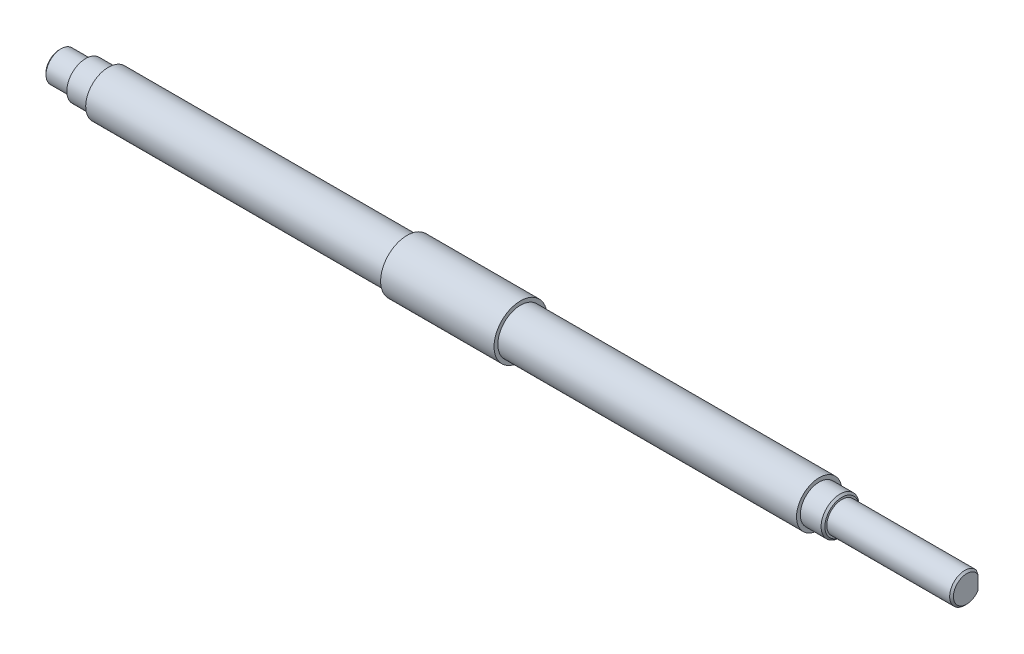
ISO-10303-21;
HEADER;
FILE_DESCRIPTION(('STEP AP214'),'2;1');
FILE_NAME('part.step','',(''),(''),'','','');
FILE_SCHEMA(('AUTOMOTIVE_DESIGN { 1 0 10303 214 1 1 1 1 }'));
ENDSEC;
DATA;
#1=APPLICATION_CONTEXT('core data for automotive mechanical design processes');
#2=APPLICATION_PROTOCOL_DEFINITION('international standard','automotive_design',2000,#1);
#3=PRODUCT_CONTEXT('',#1,'mechanical');
#4=PRODUCT('Part','Part','',(#3));
#5=PRODUCT_RELATED_PRODUCT_CATEGORY('part','',(#4));
#6=PRODUCT_DEFINITION_FORMATION('','',#4);
#7=PRODUCT_DEFINITION_CONTEXT('part definition',#1,'design');
#8=PRODUCT_DEFINITION('design','',#6,#7);
#9=PRODUCT_DEFINITION_SHAPE('','',#8);
#10=(LENGTH_UNIT() NAMED_UNIT(*) SI_UNIT(.MILLI.,.METRE.));
#11=(NAMED_UNIT(*) PLANE_ANGLE_UNIT() SI_UNIT($,.RADIAN.));
#12=(NAMED_UNIT(*) SI_UNIT($,.STERADIAN.) SOLID_ANGLE_UNIT());
#13=UNCERTAINTY_MEASURE_WITH_UNIT(LENGTH_MEASURE(1.E-05),#10,'distance_accuracy_value','');
#14=(GEOMETRIC_REPRESENTATION_CONTEXT(3) GLOBAL_UNCERTAINTY_ASSIGNED_CONTEXT((#13)) GLOBAL_UNIT_ASSIGNED_CONTEXT((#10,
#11,#12)) REPRESENTATION_CONTEXT('',''));
#15=CARTESIAN_POINT('',(0.,0.,0.));
#16=DIRECTION('',(0.,0.,1.));
#17=DIRECTION('',(1.,0.,0.));
#18=AXIS2_PLACEMENT_3D('',#15,#16,#17);
#19=CARTESIAN_POINT('',(-107.,0.,0.));
#20=DIRECTION('',(-1.,0.,0.));
#21=DIRECTION('',(0.,-1.,0.));
#22=AXIS2_PLACEMENT_3D('',#19,#20,#21);
#23=CYLINDRICAL_SURFACE('',#22,4.);
#24=CARTESIAN_POINT('',(100.,0.,0.));
#25=DIRECTION('',(-1.,0.,0.));
#26=DIRECTION('',(0.,-1.,0.));
#27=AXIS2_PLACEMENT_3D('',#24,#25,#26);
#28=CIRCLE('',#27,4.);
#29=CARTESIAN_POINT('',(100.,-3.99999999999993,0.));
#30=VERTEX_POINT('',#29);
#31=EDGE_CURVE('E87',#30,#30,#28,.T.);
#32=ORIENTED_EDGE('',*,*,#31,.F.);
#33=EDGE_LOOP('',(#32));
#34=FACE_BOUND('',#33,.T.);
#35=DIRECTION('',(-1.,0.,0.));
#36=VECTOR('',#35,1.);
#37=CARTESIAN_POINT('',(-107.,-2.64575131106457,-3.));
#38=LINE('',#37,#36);
#39=CARTESIAN_POINT('',(132.5,-2.64575131106451,-3.));
#40=VERTEX_POINT('',#39);
#41=CARTESIAN_POINT('',(113.,-2.64575131106452,-3.));
#42=VERTEX_POINT('',#41);
#43=EDGE_CURVE('E82',#40,#42,#38,.T.);
#44=ORIENTED_EDGE('',*,*,#43,.F.);
#45=CARTESIAN_POINT('',(132.5,0.,0.));
#46=DIRECTION('',(-1.,0.,0.));
#47=DIRECTION('',(0.,-1.,0.));
#48=AXIS2_PLACEMENT_3D('',#45,#46,#47);
#49=CIRCLE('',#48,4.);
#50=CARTESIAN_POINT('',(132.5,2.64575131106467,-3.));
#51=VERTEX_POINT('',#50);
#52=EDGE_CURVE('E77',#40,#51,#49,.T.);
#53=ORIENTED_EDGE('',*,*,#52,.T.);
#54=DIRECTION('',(-1.,0.,0.));
#55=VECTOR('',#54,1.);
#56=CARTESIAN_POINT('',(-107.,2.64575131106461,-3.));
#57=LINE('',#56,#55);
#58=CARTESIAN_POINT('',(113.,2.64575131106466,-3.));
#59=VERTEX_POINT('',#58);
#60=EDGE_CURVE('E81',#59,#51,#57,.F.);
#61=ORIENTED_EDGE('',*,*,#60,.F.);
#62=CARTESIAN_POINT('',(113.,0.,0.));
#63=DIRECTION('',(-1.,0.,0.));
#64=DIRECTION('',(0.,0.,1.));
#65=AXIS2_PLACEMENT_3D('',#62,#63,#64);
#66=CIRCLE('',#65,4.);
#67=EDGE_CURVE('E70',#59,#42,#66,.T.);
#68=ORIENTED_EDGE('',*,*,#67,.T.);
#69=EDGE_LOOP('',(#44,#53,#61,#68));
#70=FACE_BOUND('',#69,.T.);
#71=ADVANCED_FACE('F35',(#34,#70),#23,.T.);
#72=CARTESIAN_POINT('',(133.,4.00000000000008,0.));
#73=DIRECTION('',(-1.,0.,0.));
#74=DIRECTION('',(0.,-1.,0.));
#75=AXIS2_PLACEMENT_3D('',#72,#73,#74);
#76=PLANE('',#75);
#77=DIRECTION('',(0.,-1.,0.));
#78=VECTOR('',#77,1.);
#79=CARTESIAN_POINT('',(133.,4.00000000000008,-3.));
#80=LINE('',#79,#78);
#81=CARTESIAN_POINT('',(133.,1.80277563773218,-3.));
#82=VERTEX_POINT('',#81);
#83=CARTESIAN_POINT('',(133.,-1.80277563773203,-3.));
#84=VERTEX_POINT('',#83);
#85=EDGE_CURVE('E78',#82,#84,#80,.T.);
#86=ORIENTED_EDGE('',*,*,#85,.F.);
#87=CARTESIAN_POINT('',(133.,0.,0.));
#88=DIRECTION('',(-1.,0.,0.));
#89=DIRECTION('',(0.,-1.,0.));
#90=AXIS2_PLACEMENT_3D('',#87,#88,#89);
#91=CIRCLE('',#90,3.50000000000006);
#92=EDGE_CURVE('E49',#82,#84,#91,.F.);
#93=ORIENTED_EDGE('',*,*,#92,.T.);
#94=EDGE_LOOP('',(#86,#93));
#95=FACE_BOUND('',#94,.T.);
#96=ADVANCED_FACE('F155',(#95),#76,.F.);
#97=CARTESIAN_POINT('',(-107.,0.,0.));
#98=DIRECTION('',(1.,0.,0.));
#99=DIRECTION('',(0.,1.,0.));
#100=AXIS2_PLACEMENT_3D('',#97,#98,#99);
#101=PLANE('',#100);
#102=CARTESIAN_POINT('',(-107.,0.,0.));
#103=DIRECTION('',(1.,0.,0.));
#104=DIRECTION('',(0.,1.,0.));
#105=AXIS2_PLACEMENT_3D('',#102,#103,#104);
#106=CIRCLE('',#105,3.49999999999995);
#107=CARTESIAN_POINT('',(-107.,3.49999999999996,0.));
#108=VERTEX_POINT('',#107);
#109=EDGE_CURVE('E43',#108,#108,#106,.F.);
#110=ORIENTED_EDGE('',*,*,#109,.T.);
#111=EDGE_LOOP('',(#110));
#112=FACE_BOUND('',#111,.T.);
#113=ADVANCED_FACE('F143',(#112),#101,.F.);
#114=CARTESIAN_POINT('',(-107.,0.,0.));
#115=DIRECTION('',(-1.,0.,0.));
#116=DIRECTION('',(0.,-1.,0.));
#117=AXIS2_PLACEMENT_3D('',#114,#115,#116);
#118=CYLINDRICAL_SURFACE('',#117,4.);
#119=CARTESIAN_POINT('',(-106.5,0.,0.));
#120=DIRECTION('',(1.,0.,0.));
#121=DIRECTION('',(0.,1.,0.));
#122=AXIS2_PLACEMENT_3D('',#119,#120,#121);
#123=CIRCLE('',#122,4.);
#124=CARTESIAN_POINT('',(-106.5,4.00000000000002,0.));
#125=VERTEX_POINT('',#124);
#126=EDGE_CURVE('E11',#125,#125,#123,.T.);
#127=ORIENTED_EDGE('',*,*,#126,.T.);
#128=EDGE_LOOP('',(#127));
#129=FACE_BOUND('',#128,.T.);
#130=CARTESIAN_POINT('',(-100.,0.,0.));
#131=DIRECTION('',(-1.,0.,0.));
#132=DIRECTION('',(0.,-1.,0.));
#133=AXIS2_PLACEMENT_3D('',#130,#131,#132);
#134=CIRCLE('',#133,4.);
#135=CARTESIAN_POINT('',(-100.,-3.99999999999998,0.));
#136=VERTEX_POINT('',#135);
#137=EDGE_CURVE('E119',#136,#136,#134,.T.);
#138=ORIENTED_EDGE('',*,*,#137,.T.);
#139=EDGE_LOOP('',(#138));
#140=FACE_BOUND('',#139,.T.);
#141=ADVANCED_FACE('F207',(#129,#140),#118,.T.);
#142=CARTESIAN_POINT('',(-100.,5.00000000000002,0.));
#143=DIRECTION('',(1.,0.,0.));
#144=DIRECTION('',(0.,1.,0.));
#145=AXIS2_PLACEMENT_3D('',#142,#143,#144);
#146=PLANE('',#145);
#147=ORIENTED_EDGE('',*,*,#137,.F.);
#148=EDGE_LOOP('',(#147));
#149=FACE_BOUND('',#148,.T.);
#150=CARTESIAN_POINT('',(-100.,0.,0.));
#151=DIRECTION('',(-1.,0.,0.));
#152=DIRECTION('',(0.,-1.,0.));
#153=AXIS2_PLACEMENT_3D('',#150,#151,#152);
#154=CIRCLE('',#153,5.);
#155=CARTESIAN_POINT('',(-100.,-4.99999999999998,0.));
#156=VERTEX_POINT('',#155);
#157=EDGE_CURVE('E116',#156,#156,#154,.T.);
#158=ORIENTED_EDGE('',*,*,#157,.T.);
#159=EDGE_LOOP('',(#158));
#160=FACE_BOUND('',#159,.T.);
#161=ADVANCED_FACE('F204',(#149,#160),#146,.F.);
#162=CARTESIAN_POINT('',(-107.,0.,0.));
#163=DIRECTION('',(-1.,0.,0.));
#164=DIRECTION('',(0.,-1.,0.));
#165=AXIS2_PLACEMENT_3D('',#162,#163,#164);
#166=CYLINDRICAL_SURFACE('',#165,5.);
#167=ORIENTED_EDGE('',*,*,#157,.F.);
#168=EDGE_LOOP('',(#167));
#169=FACE_BOUND('',#168,.T.);
#170=CARTESIAN_POINT('',(-94.,0.,0.));
#171=DIRECTION('',(-1.,0.,0.));
#172=DIRECTION('',(0.,-1.,0.));
#173=AXIS2_PLACEMENT_3D('',#170,#171,#172);
#174=CIRCLE('',#173,5.);
#175=CARTESIAN_POINT('',(-94.,-4.99999999999998,0.));
#176=VERTEX_POINT('',#175);
#177=EDGE_CURVE('E113',#176,#176,#174,.T.);
#178=ORIENTED_EDGE('',*,*,#177,.T.);
#179=EDGE_LOOP('',(#178));
#180=FACE_BOUND('',#179,.T.);
#181=ADVANCED_FACE('F200',(#169,#180),#166,.T.);
#182=CARTESIAN_POINT('',(-94.,5.00000000000002,0.));
#183=DIRECTION('',(1.,0.,0.));
#184=DIRECTION('',(0.,1.,0.));
#185=AXIS2_PLACEMENT_3D('',#182,#183,#184);
#186=PLANE('',#185);
#187=ORIENTED_EDGE('',*,*,#177,.F.);
#188=EDGE_LOOP('',(#187));
#189=FACE_BOUND('',#188,.T.);
#190=CARTESIAN_POINT('',(-94.,0.,0.));
#191=DIRECTION('',(-1.,0.,0.));
#192=DIRECTION('',(0.,-1.,0.));
#193=AXIS2_PLACEMENT_3D('',#190,#191,#192);
#194=CIRCLE('',#193,6.);
#195=CARTESIAN_POINT('',(-94.,-5.99999999999998,0.));
#196=VERTEX_POINT('',#195);
#197=EDGE_CURVE('E110',#196,#196,#194,.T.);
#198=ORIENTED_EDGE('',*,*,#197,.T.);
#199=EDGE_LOOP('',(#198));
#200=FACE_BOUND('',#199,.T.);
#201=ADVANCED_FACE('F196',(#189,#200),#186,.F.);
#202=CARTESIAN_POINT('',(-107.,0.,0.));
#203=DIRECTION('',(-1.,0.,0.));
#204=DIRECTION('',(0.,-1.,0.));
#205=AXIS2_PLACEMENT_3D('',#202,#203,#204);
#206=CYLINDRICAL_SURFACE('',#205,5.99999999999998);
#207=ORIENTED_EDGE('',*,*,#197,.F.);
#208=EDGE_LOOP('',(#207));
#209=FACE_BOUND('',#208,.T.);
#210=CARTESIAN_POINT('',(-15.,0.,0.));
#211=DIRECTION('',(-1.,0.,0.));
#212=DIRECTION('',(0.,-1.,0.));
#213=AXIS2_PLACEMENT_3D('',#210,#211,#212);
#214=CIRCLE('',#213,5.99999999999996);
#215=CARTESIAN_POINT('',(-15.,-5.99999999999992,0.));
#216=VERTEX_POINT('',#215);
#217=EDGE_CURVE('E107',#216,#216,#214,.T.);
#218=ORIENTED_EDGE('',*,*,#217,.T.);
#219=EDGE_LOOP('',(#218));
#220=FACE_BOUND('',#219,.T.);
#221=ADVANCED_FACE('F192',(#209,#220),#206,.T.);
#222=CARTESIAN_POINT('',(-15.,6.,0.));
#223=DIRECTION('',(1.,0.,0.));
#224=DIRECTION('',(0.,1.,0.));
#225=AXIS2_PLACEMENT_3D('',#222,#223,#224);
#226=PLANE('',#225);
#227=ORIENTED_EDGE('',*,*,#217,.F.);
#228=EDGE_LOOP('',(#227));
#229=FACE_BOUND('',#228,.T.);
#230=CARTESIAN_POINT('',(-15.,0.,0.));
#231=DIRECTION('',(-1.,0.,0.));
#232=DIRECTION('',(0.,-1.,0.));
#233=AXIS2_PLACEMENT_3D('',#230,#231,#232);
#234=CIRCLE('',#233,7.);
#235=CARTESIAN_POINT('',(-15.,-6.99999999999996,0.));
#236=VERTEX_POINT('',#235);
#237=EDGE_CURVE('E104',#236,#236,#234,.T.);
#238=ORIENTED_EDGE('',*,*,#237,.T.);
#239=EDGE_LOOP('',(#238));
#240=FACE_BOUND('',#239,.T.);
#241=ADVANCED_FACE('F188',(#229,#240),#226,.F.);
#242=CARTESIAN_POINT('',(-107.,0.,0.));
#243=DIRECTION('',(-1.,0.,0.));
#244=DIRECTION('',(0.,-1.,0.));
#245=AXIS2_PLACEMENT_3D('',#242,#243,#244);
#246=CYLINDRICAL_SURFACE('',#245,7.);
#247=ORIENTED_EDGE('',*,*,#237,.F.);
#248=EDGE_LOOP('',(#247));
#249=FACE_BOUND('',#248,.T.);
#250=CARTESIAN_POINT('',(15.,0.,0.));
#251=DIRECTION('',(-1.,0.,0.));
#252=DIRECTION('',(0.,-1.,0.));
#253=AXIS2_PLACEMENT_3D('',#250,#251,#252);
#254=CIRCLE('',#253,6.99999999999999);
#255=CARTESIAN_POINT('',(15.,-6.99999999999995,0.));
#256=VERTEX_POINT('',#255);
#257=EDGE_CURVE('E101',#256,#256,#254,.T.);
#258=ORIENTED_EDGE('',*,*,#257,.T.);
#259=EDGE_LOOP('',(#258));
#260=FACE_BOUND('',#259,.T.);
#261=ADVANCED_FACE('F184',(#249,#260),#246,.T.);
#262=CARTESIAN_POINT('',(15.,7.00000000000004,0.));
#263=DIRECTION('',(-1.,0.,0.));
#264=DIRECTION('',(0.,-1.,0.));
#265=AXIS2_PLACEMENT_3D('',#262,#263,#264);
#266=PLANE('',#265);
#267=ORIENTED_EDGE('',*,*,#257,.F.);
#268=EDGE_LOOP('',(#267));
#269=FACE_BOUND('',#268,.T.);
#270=CARTESIAN_POINT('',(15.,0.,0.));
#271=DIRECTION('',(-1.,0.,0.));
#272=DIRECTION('',(0.,-1.,0.));
#273=AXIS2_PLACEMENT_3D('',#270,#271,#272);
#274=CIRCLE('',#273,5.99999999999995);
#275=CARTESIAN_POINT('',(15.,-5.99999999999991,0.));
#276=VERTEX_POINT('',#275);
#277=EDGE_CURVE('E98',#276,#276,#274,.T.);
#278=ORIENTED_EDGE('',*,*,#277,.T.);
#279=EDGE_LOOP('',(#278));
#280=FACE_BOUND('',#279,.T.);
#281=ADVANCED_FACE('F180',(#269,#280),#266,.F.);
#282=CARTESIAN_POINT('',(-107.,0.,0.));
#283=DIRECTION('',(-1.,0.,0.));
#284=DIRECTION('',(0.,-1.,0.));
#285=AXIS2_PLACEMENT_3D('',#282,#283,#284);
#286=CYLINDRICAL_SURFACE('',#285,5.99999999999998);
#287=ORIENTED_EDGE('',*,*,#277,.F.);
#288=EDGE_LOOP('',(#287));
#289=FACE_BOUND('',#288,.T.);
#290=CARTESIAN_POINT('',(94.,0.,0.));
#291=DIRECTION('',(-1.,0.,0.));
#292=DIRECTION('',(0.,-1.,0.));
#293=AXIS2_PLACEMENT_3D('',#290,#291,#292);
#294=CIRCLE('',#293,6.);
#295=CARTESIAN_POINT('',(94.,-5.99999999999993,0.));
#296=VERTEX_POINT('',#295);
#297=EDGE_CURVE('E95',#296,#296,#294,.T.);
#298=ORIENTED_EDGE('',*,*,#297,.T.);
#299=EDGE_LOOP('',(#298));
#300=FACE_BOUND('',#299,.T.);
#301=ADVANCED_FACE('F176',(#289,#300),#286,.T.);
#302=CARTESIAN_POINT('',(94.,6.00000000000007,0.));
#303=DIRECTION('',(-1.,0.,0.));
#304=DIRECTION('',(0.,-1.,0.));
#305=AXIS2_PLACEMENT_3D('',#302,#303,#304);
#306=PLANE('',#305);
#307=ORIENTED_EDGE('',*,*,#297,.F.);
#308=EDGE_LOOP('',(#307));
#309=FACE_BOUND('',#308,.T.);
#310=CARTESIAN_POINT('',(94.,0.,0.));
#311=DIRECTION('',(-1.,0.,0.));
#312=DIRECTION('',(0.,-1.,0.));
#313=AXIS2_PLACEMENT_3D('',#310,#311,#312);
#314=CIRCLE('',#313,5.);
#315=CARTESIAN_POINT('',(94.,-4.99999999999993,0.));
#316=VERTEX_POINT('',#315);
#317=EDGE_CURVE('E92',#316,#316,#314,.T.);
#318=ORIENTED_EDGE('',*,*,#317,.T.);
#319=EDGE_LOOP('',(#318));
#320=FACE_BOUND('',#319,.T.);
#321=ADVANCED_FACE('F172',(#309,#320),#306,.F.);
#322=CARTESIAN_POINT('',(-107.,0.,0.));
#323=DIRECTION('',(-1.,0.,0.));
#324=DIRECTION('',(0.,-1.,0.));
#325=AXIS2_PLACEMENT_3D('',#322,#323,#324);
#326=CYLINDRICAL_SURFACE('',#325,5.);
#327=CARTESIAN_POINT('',(99.4999999999999,0.,0.));
#328=DIRECTION('',(-1.,0.,0.));
#329=DIRECTION('',(0.,-1.,0.));
#330=AXIS2_PLACEMENT_3D('',#327,#328,#329);
#331=CIRCLE('',#330,5.);
#332=CARTESIAN_POINT('',(99.4999999999999,-4.99999999999993,0.));
#333=VERTEX_POINT('',#332);
#334=EDGE_CURVE('E242',#333,#333,#331,.T.);
#335=ORIENTED_EDGE('',*,*,#334,.T.);
#336=EDGE_LOOP('',(#335));
#337=FACE_BOUND('',#336,.T.);
#338=ORIENTED_EDGE('',*,*,#317,.F.);
#339=EDGE_LOOP('',(#338));
#340=FACE_BOUND('',#339,.T.);
#341=ADVANCED_FACE('F168',(#337,#340),#326,.T.);
#342=CARTESIAN_POINT('',(100.,5.00000000000007,0.));
#343=DIRECTION('',(-1.,0.,0.));
#344=DIRECTION('',(0.,-1.,0.));
#345=AXIS2_PLACEMENT_3D('',#342,#343,#344);
#346=PLANE('',#345);
#347=CARTESIAN_POINT('',(100.,0.,0.));
#348=DIRECTION('',(-1.,0.,0.));
#349=DIRECTION('',(0.,-1.,0.));
#350=AXIS2_PLACEMENT_3D('',#347,#348,#349);
#351=CIRCLE('',#350,4.49999999999995);
#352=CARTESIAN_POINT('',(100.,-4.49999999999988,0.));
#353=VERTEX_POINT('',#352);
#354=EDGE_CURVE('E240',#353,#353,#351,.F.);
#355=ORIENTED_EDGE('',*,*,#354,.T.);
#356=EDGE_LOOP('',(#355));
#357=FACE_BOUND('',#356,.T.);
#358=ORIENTED_EDGE('',*,*,#31,.T.);
#359=EDGE_LOOP('',(#358));
#360=FACE_BOUND('',#359,.T.);
#361=ADVANCED_FACE('F165',(#357,#360),#346,.F.);
#362=CARTESIAN_POINT('',(113.,-9.43965913505541,-13.));
#363=DIRECTION('',(-1.,0.,0.));
#364=DIRECTION('',(0.,0.,1.));
#365=AXIS2_PLACEMENT_3D('',#362,#363,#364);
#366=PLANE('',#365);
#367=DIRECTION('',(0.,-1.,0.));
#368=VECTOR('',#367,1.);
#369=CARTESIAN_POINT('',(113.,-9.43965913505541,-3.));
#370=LINE('',#369,#368);
#371=EDGE_CURVE('E73',#59,#42,#370,.T.);
#372=ORIENTED_EDGE('',*,*,#371,.T.);
#373=ORIENTED_EDGE('',*,*,#67,.F.);
#374=EDGE_LOOP('',(#372,#373));
#375=FACE_BOUND('',#374,.T.);
#376=ADVANCED_FACE('F72',(#375),#366,.F.);
#377=CARTESIAN_POINT('',(0.,0.,-3.));
#378=DIRECTION('',(0.,0.,-1.));
#379=DIRECTION('',(-1.,0.,0.));
#380=AXIS2_PLACEMENT_3D('',#377,#378,#379);
#381=PLANE('',#380);
#382=ORIENTED_EDGE('',*,*,#60,.T.);
#383=CARTESIAN_POINT('',(132.5,2.64575131106467,-3.));
#384=CARTESIAN_POINT('',(132.545085069971,2.57757568188949,-3.));
#385=CARTESIAN_POINT('',(132.589503768524,2.50895192112237,-3.));
#386=CARTESIAN_POINT('',(132.676709499218,2.37074655282749,-3.));
#387=CARTESIAN_POINT('',(132.719497696405,2.30116567947629,-3.));
#388=CARTESIAN_POINT('',(132.803216288563,2.16087490205677,-3.));
#389=CARTESIAN_POINT('',(132.844146401839,2.09016482897725,-3.));
#390=CARTESIAN_POINT('',(132.923815408471,1.94745530519487,-3.));
#391=CARTESIAN_POINT('',(132.962552680524,1.87545495098036,-3.));
#392=CARTESIAN_POINT('',(133.,1.80277563773217,-3.));
#393=B_SPLINE_CURVE_WITH_KNOTS('',3,(#383,#384,#385,#386,#387,#388,#389,#390,#391,#392),
.UNSPECIFIED.,.F.,.F.,(4,2,2,2,4),(0.,0.245209378122393,0.490240129157556,0.735307905060984,
0.980554569568414),.UNSPECIFIED.);
#394=EDGE_CURVE('E56',#51,#82,#393,.T.);
#395=ORIENTED_EDGE('',*,*,#394,.T.);
#396=ORIENTED_EDGE('',*,*,#85,.T.);
#397=CARTESIAN_POINT('',(133.,-1.80277563773203,-3.));
#398=CARTESIAN_POINT('',(132.962552680524,-1.87545495098021,-3.));
#399=CARTESIAN_POINT('',(132.923815408471,-1.94745530519472,-3.));
#400=CARTESIAN_POINT('',(132.844146401839,-2.0901648289771,-3.));
#401=CARTESIAN_POINT('',(132.803216288563,-2.16087490205662,-3.));
#402=CARTESIAN_POINT('',(132.719497696405,-2.30116567947614,-3.));
#403=CARTESIAN_POINT('',(132.676709499218,-2.37074655282734,-3.));
#404=CARTESIAN_POINT('',(132.589503768524,-2.50895192112222,-3.));
#405=CARTESIAN_POINT('',(132.545085069971,-2.57757568188934,-3.));
#406=CARTESIAN_POINT('',(132.5,-2.64575131106452,-3.));
#407=B_SPLINE_CURVE_WITH_KNOTS('',3,(#397,#398,#399,#400,#401,#402,#403,#404,#405,#406),
.UNSPECIFIED.,.F.,.F.,(4,2,2,2,4),(0.,0.245246664507427,0.490314440410855,0.735345191446017,
0.980554569568409),.UNSPECIFIED.);
#408=EDGE_CURVE('E124',#84,#40,#407,.T.);
#409=ORIENTED_EDGE('',*,*,#408,.T.);
#410=ORIENTED_EDGE('',*,*,#43,.T.);
#411=ORIENTED_EDGE('',*,*,#371,.F.);
#412=EDGE_LOOP('',(#382,#395,#396,#409,#410,#411));
#413=FACE_BOUND('',#412,.T.);
#414=ADVANCED_FACE('F80',(#413),#381,.T.);
#415=CARTESIAN_POINT('',(132.5,0.,0.));
#416=DIRECTION('',(-1.,0.,0.));
#417=DIRECTION('',(0.,-1.,0.));
#418=AXIS2_PLACEMENT_3D('',#415,#416,#417);
#419=CONICAL_SURFACE('',#418,4.,0.785398163397445);
#420=ORIENTED_EDGE('',*,*,#408,.F.);
#421=ORIENTED_EDGE('',*,*,#92,.F.);
#422=ORIENTED_EDGE('',*,*,#394,.F.);
#423=ORIENTED_EDGE('',*,*,#52,.F.);
#424=EDGE_LOOP('',(#420,#421,#422,#423));
#425=FACE_BOUND('',#424,.T.);
#426=ADVANCED_FACE('F137',(#425),#419,.T.);
#427=CARTESIAN_POINT('',(99.4999999999999,0.,0.));
#428=DIRECTION('',(-1.,0.,0.));
#429=DIRECTION('',(0.,-1.,0.));
#430=AXIS2_PLACEMENT_3D('',#427,#428,#429);
#431=CONICAL_SURFACE('',#430,5.,0.785398163397446);
#432=ORIENTED_EDGE('',*,*,#354,.F.);
#433=EDGE_LOOP('',(#432));
#434=FACE_BOUND('',#433,.T.);
#435=ORIENTED_EDGE('',*,*,#334,.F.);
#436=EDGE_LOOP('',(#435));
#437=FACE_BOUND('',#436,.T.);
#438=ADVANCED_FACE('F141',(#434,#437),#431,.T.);
#439=CARTESIAN_POINT('',(-107.,0.,0.));
#440=DIRECTION('',(1.,0.,0.));
#441=DIRECTION('',(0.,1.,0.));
#442=AXIS2_PLACEMENT_3D('',#439,#440,#441);
#443=CONICAL_SURFACE('',#442,3.49999999999995,0.78539816339746);
#444=ORIENTED_EDGE('',*,*,#126,.F.);
#445=EDGE_LOOP('',(#444));
#446=FACE_BOUND('',#445,.T.);
#447=ORIENTED_EDGE('',*,*,#109,.F.);
#448=EDGE_LOOP('',(#447));
#449=FACE_BOUND('',#448,.T.);
#450=ADVANCED_FACE('F37',(#446,#449),#443,.T.);
#451=CLOSED_SHELL('',(#71,#96,#113,#141,#161,#181,#201,#221,#241,#261,#281,#301,#321,#341,#361,
#376,#414,#426,#438,#450));
#452=MANIFOLD_SOLID_BREP('B2',#451);
#453=ADVANCED_BREP_SHAPE_REPRESENTATION('',(#18,#452),#14);
#454=SHAPE_DEFINITION_REPRESENTATION(#9,#453);
ENDSEC;
END-ISO-10303-21;
